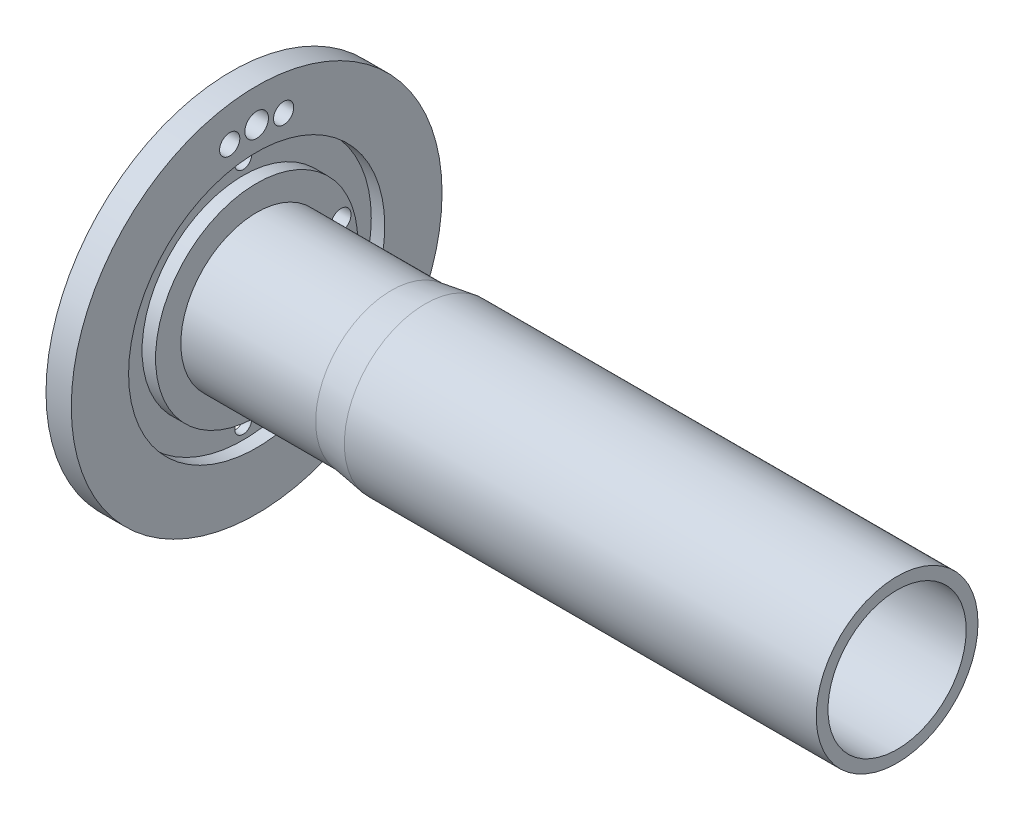
ISO-10303-21;
HEADER;
FILE_DESCRIPTION(('STEP AP214'),'2;1');
FILE_NAME('part.step','',(''),(''),'','','');
FILE_SCHEMA(('AUTOMOTIVE_DESIGN { 1 0 10303 214 1 1 1 1 }'));
ENDSEC;
DATA;
#1=APPLICATION_CONTEXT('core data for automotive mechanical design processes');
#2=APPLICATION_PROTOCOL_DEFINITION('international standard','automotive_design',2000,#1);
#3=PRODUCT_CONTEXT('',#1,'mechanical');
#4=PRODUCT('Part','Part','',(#3));
#5=PRODUCT_RELATED_PRODUCT_CATEGORY('part','',(#4));
#6=PRODUCT_DEFINITION_FORMATION('','',#4);
#7=PRODUCT_DEFINITION_CONTEXT('part definition',#1,'design');
#8=PRODUCT_DEFINITION('design','',#6,#7);
#9=PRODUCT_DEFINITION_SHAPE('','',#8);
#10=(LENGTH_UNIT() NAMED_UNIT(*) SI_UNIT(.MILLI.,.METRE.));
#11=(NAMED_UNIT(*) PLANE_ANGLE_UNIT() SI_UNIT($,.RADIAN.));
#12=(NAMED_UNIT(*) SI_UNIT($,.STERADIAN.) SOLID_ANGLE_UNIT());
#13=UNCERTAINTY_MEASURE_WITH_UNIT(LENGTH_MEASURE(1.E-05),#10,'distance_accuracy_value','');
#14=(GEOMETRIC_REPRESENTATION_CONTEXT(3) GLOBAL_UNCERTAINTY_ASSIGNED_CONTEXT((#13)) GLOBAL_UNIT_ASSIGNED_CONTEXT((#10,
#11,#12)) REPRESENTATION_CONTEXT('',''));
#15=CARTESIAN_POINT('',(0.,0.,0.));
#16=DIRECTION('',(0.,0.,1.));
#17=DIRECTION('',(1.,0.,0.));
#18=AXIS2_PLACEMENT_3D('',#15,#16,#17);
#19=CARTESIAN_POINT('',(3.,0.,0.));
#20=DIRECTION('',(-1.,0.,0.));
#21=DIRECTION('',(0.,0.,1.));
#22=AXIS2_PLACEMENT_3D('',#19,#20,#21);
#23=CYLINDRICAL_SURFACE('',#22,37.5);
#24=CARTESIAN_POINT('',(2.5,0.,0.));
#25=DIRECTION('',(-1.,0.,0.));
#26=DIRECTION('',(0.,0.,1.));
#27=AXIS2_PLACEMENT_3D('',#24,#25,#26);
#28=CIRCLE('',#27,37.5);
#29=CARTESIAN_POINT('',(2.5,37.3125,3.74530956664461));
#30=VERTEX_POINT('',#29);
#31=CARTESIAN_POINT('',(2.5,-37.3125,3.74530956664462));
#32=VERTEX_POINT('',#31);
#33=EDGE_CURVE('E60',#30,#32,#28,.F.);
#34=ORIENTED_EDGE('',*,*,#33,.F.);
#35=DIRECTION('',(-1.,0.,0.));
#36=VECTOR('',#35,1.);
#37=CARTESIAN_POINT('',(1.85,37.3125,3.74530956664462));
#38=LINE('',#37,#36);
#39=CARTESIAN_POINT('',(3.,37.3125,3.74530956664458));
#40=VERTEX_POINT('',#39);
#41=EDGE_CURVE('E155',#30,#40,#38,.F.);
#42=ORIENTED_EDGE('',*,*,#41,.T.);
#43=CARTESIAN_POINT('',(3.,0.,0.));
#44=DIRECTION('',(-1.,0.,0.));
#45=DIRECTION('',(0.,0.,1.));
#46=AXIS2_PLACEMENT_3D('',#43,#44,#45);
#47=CIRCLE('',#46,37.5);
#48=CARTESIAN_POINT('',(3.,-37.3125,3.74530956664458));
#49=VERTEX_POINT('',#48);
#50=EDGE_CURVE('E368',#49,#40,#47,.T.);
#51=ORIENTED_EDGE('',*,*,#50,.F.);
#52=DIRECTION('',(-1.,0.,0.));
#53=VECTOR('',#52,1.);
#54=CARTESIAN_POINT('',(1.85,-37.3125,3.74530956664462));
#55=LINE('',#54,#53);
#56=EDGE_CURVE('E134',#49,#32,#55,.T.);
#57=ORIENTED_EDGE('',*,*,#56,.T.);
#58=EDGE_LOOP('',(#34,#42,#51,#57));
#59=FACE_BOUND('',#58,.T.);
#60=ADVANCED_FACE('F43',(#59),#23,.F.);
#61=CARTESIAN_POINT('',(3.,0.,0.));
#62=DIRECTION('',(-1.,0.,0.));
#63=DIRECTION('',(0.,0.,1.));
#64=AXIS2_PLACEMENT_3D('',#61,#62,#63);
#65=CYLINDRICAL_SURFACE('',#64,30.5);
#66=DIRECTION('',(-1.,0.,0.));
#67=VECTOR('',#66,1.);
#68=CARTESIAN_POINT('',(1.85,30.3125,3.37673566481002));
#69=LINE('',#68,#67);
#70=CARTESIAN_POINT('',(2.5,30.3125,3.37673566481002));
#71=VERTEX_POINT('',#70);
#72=CARTESIAN_POINT('',(3.,30.3125,3.37673566481002));
#73=VERTEX_POINT('',#72);
#74=EDGE_CURVE('E127',#71,#73,#69,.F.);
#75=ORIENTED_EDGE('',*,*,#74,.F.);
#76=CARTESIAN_POINT('',(2.5,0.,0.));
#77=DIRECTION('',(-1.,0.,0.));
#78=DIRECTION('',(0.,0.,1.));
#79=AXIS2_PLACEMENT_3D('',#76,#77,#78);
#80=CIRCLE('',#79,30.5);
#81=CARTESIAN_POINT('',(2.5,-30.3125,3.37673566481002));
#82=VERTEX_POINT('',#81);
#83=EDGE_CURVE('E114',#71,#82,#80,.F.);
#84=ORIENTED_EDGE('',*,*,#83,.T.);
#85=DIRECTION('',(-1.,0.,0.));
#86=VECTOR('',#85,1.);
#87=CARTESIAN_POINT('',(1.85,-30.3125,3.37673566481002));
#88=LINE('',#87,#86);
#89=CARTESIAN_POINT('',(3.,-30.3125,3.37673566481));
#90=VERTEX_POINT('',#89);
#91=EDGE_CURVE('E12',#90,#82,#88,.T.);
#92=ORIENTED_EDGE('',*,*,#91,.F.);
#93=CARTESIAN_POINT('',(3.,0.,0.));
#94=DIRECTION('',(-1.,0.,0.));
#95=DIRECTION('',(0.,0.,1.));
#96=AXIS2_PLACEMENT_3D('',#93,#94,#95);
#97=CIRCLE('',#96,30.5);
#98=EDGE_CURVE('E371',#90,#73,#97,.T.);
#99=ORIENTED_EDGE('',*,*,#98,.T.);
#100=EDGE_LOOP('',(#75,#84,#92,#99));
#101=FACE_BOUND('',#100,.T.);
#102=ADVANCED_FACE('F124',(#101),#65,.T.);
#103=CARTESIAN_POINT('',(10.,0.,0.));
#104=DIRECTION('',(-1.,0.,0.));
#105=DIRECTION('',(0.,0.,1.));
#106=AXIS2_PLACEMENT_3D('',#103,#104,#105);
#107=CYLINDRICAL_SURFACE('',#106,55.);
#108=CARTESIAN_POINT('',(10.,0.,0.));
#109=DIRECTION('',(1.,0.,0.));
#110=DIRECTION('',(0.,0.,-1.));
#111=AXIS2_PLACEMENT_3D('',#108,#109,#110);
#112=CIRCLE('',#111,55.);
#113=CARTESIAN_POINT('',(10.,0.,-55.));
#114=VERTEX_POINT('',#113);
#115=EDGE_CURVE('E345',#114,#114,#112,.T.);
#116=ORIENTED_EDGE('',*,*,#115,.F.);
#117=EDGE_LOOP('',(#116));
#118=FACE_BOUND('',#117,.T.);
#119=CARTESIAN_POINT('',(2.5,0.,0.));
#120=DIRECTION('',(-1.,0.,0.));
#121=DIRECTION('',(0.,0.,1.));
#122=AXIS2_PLACEMENT_3D('',#119,#120,#121);
#123=CIRCLE('',#122,55.);
#124=CARTESIAN_POINT('',(2.5,0.,55.));
#125=VERTEX_POINT('',#124);
#126=EDGE_CURVE('E401',#125,#125,#123,.T.);
#127=ORIENTED_EDGE('',*,*,#126,.F.);
#128=EDGE_LOOP('',(#127));
#129=FACE_BOUND('',#128,.T.);
#130=ADVANCED_FACE('F45',(#118,#129),#107,.T.);
#131=CARTESIAN_POINT('',(50.,0.,0.));
#132=DIRECTION('',(-1.,0.,0.));
#133=DIRECTION('',(0.,0.,1.));
#134=AXIS2_PLACEMENT_3D('',#131,#132,#133);
#135=CYLINDRICAL_SURFACE('',#134,19.);
#136=CARTESIAN_POINT('',(50.,0.,0.));
#137=DIRECTION('',(-1.,0.,0.));
#138=DIRECTION('',(0.,0.,1.));
#139=AXIS2_PLACEMENT_3D('',#136,#137,#138);
#140=CIRCLE('',#139,19.);
#141=CARTESIAN_POINT('',(50.,0.,19.));
#142=VERTEX_POINT('',#141);
#143=EDGE_CURVE('E321',#142,#142,#140,.T.);
#144=ORIENTED_EDGE('',*,*,#143,.F.);
#145=EDGE_LOOP('',(#144));
#146=FACE_BOUND('',#145,.T.);
#147=CARTESIAN_POINT('',(2.5,0.,0.));
#148=DIRECTION('',(-1.,0.,0.));
#149=DIRECTION('',(0.,0.,1.));
#150=AXIS2_PLACEMENT_3D('',#147,#148,#149);
#151=CIRCLE('',#150,19.);
#152=CARTESIAN_POINT('',(2.5,0.,19.));
#153=VERTEX_POINT('',#152);
#154=EDGE_CURVE('E403',#153,#153,#151,.F.);
#155=ORIENTED_EDGE('',*,*,#154,.F.);
#156=EDGE_LOOP('',(#155));
#157=FACE_BOUND('',#156,.T.);
#158=ADVANCED_FACE('F312',(#146,#157),#135,.F.);
#159=CARTESIAN_POINT('',(2.5,0.,0.));
#160=DIRECTION('',(-1.,0.,0.));
#161=DIRECTION('',(0.,0.,1.));
#162=AXIS2_PLACEMENT_3D('',#159,#160,#161);
#163=CIRCLE('',#162,37.5);
#164=CARTESIAN_POINT('',(2.5,-37.3125,-3.74530956664463));
#165=VERTEX_POINT('',#164);
#166=CARTESIAN_POINT('',(2.5,37.3125,-3.74530956664461));
#167=VERTEX_POINT('',#166);
#168=EDGE_CURVE('E458',#165,#167,#163,.F.);
#169=ORIENTED_EDGE('',*,*,#168,.F.);
#170=DIRECTION('',(-1.,0.,0.));
#171=VECTOR('',#170,1.);
#172=CARTESIAN_POINT('',(1.85,-37.3125,-3.74530956664462));
#173=LINE('',#172,#171);
#174=CARTESIAN_POINT('',(3.,-37.3125,-3.74530956664458));
#175=VERTEX_POINT('',#174);
#176=EDGE_CURVE('E138',#165,#175,#173,.F.);
#177=ORIENTED_EDGE('',*,*,#176,.T.);
#178=CARTESIAN_POINT('',(3.,37.3125,-3.74530956664458));
#179=VERTEX_POINT('',#178);
#180=EDGE_CURVE('E346',#179,#175,#47,.T.);
#181=ORIENTED_EDGE('',*,*,#180,.F.);
#182=DIRECTION('',(-1.,0.,0.));
#183=VECTOR('',#182,1.);
#184=CARTESIAN_POINT('',(1.85,37.3125,-3.74530956664462));
#185=LINE('',#184,#183);
#186=EDGE_CURVE('E146',#179,#167,#185,.T.);
#187=ORIENTED_EDGE('',*,*,#186,.T.);
#188=EDGE_LOOP('',(#169,#177,#181,#187));
#189=FACE_BOUND('',#188,.T.);
#190=ADVANCED_FACE('F311',(#189),#23,.F.);
#191=DIRECTION('',(-1.,0.,0.));
#192=VECTOR('',#191,1.);
#193=CARTESIAN_POINT('',(1.85,-30.3125,-3.37673566481002));
#194=LINE('',#193,#192);
#195=CARTESIAN_POINT('',(2.5,-30.3125,-3.37673566481002));
#196=VERTEX_POINT('',#195);
#197=CARTESIAN_POINT('',(3.,-30.3125,-3.37673566481002));
#198=VERTEX_POINT('',#197);
#199=EDGE_CURVE('E52',#196,#198,#194,.F.);
#200=ORIENTED_EDGE('',*,*,#199,.F.);
#201=CARTESIAN_POINT('',(2.5,0.,0.));
#202=DIRECTION('',(-1.,0.,0.));
#203=DIRECTION('',(0.,0.,1.));
#204=AXIS2_PLACEMENT_3D('',#201,#202,#203);
#205=CIRCLE('',#204,30.5);
#206=CARTESIAN_POINT('',(2.5,30.3125,-3.37673566481002));
#207=VERTEX_POINT('',#206);
#208=EDGE_CURVE('E68',#196,#207,#205,.F.);
#209=ORIENTED_EDGE('',*,*,#208,.T.);
#210=DIRECTION('',(-1.,0.,0.));
#211=VECTOR('',#210,1.);
#212=CARTESIAN_POINT('',(1.85,30.3125,-3.37673566481002));
#213=LINE('',#212,#211);
#214=CARTESIAN_POINT('',(3.,30.3125,-3.37673566481002));
#215=VERTEX_POINT('',#214);
#216=EDGE_CURVE('E349',#215,#207,#213,.T.);
#217=ORIENTED_EDGE('',*,*,#216,.F.);
#218=EDGE_CURVE('E370',#215,#198,#97,.T.);
#219=ORIENTED_EDGE('',*,*,#218,.T.);
#220=EDGE_LOOP('',(#200,#209,#217,#219));
#221=FACE_BOUND('',#220,.T.);
#222=ADVANCED_FACE('F276',(#221),#65,.T.);
#223=CARTESIAN_POINT('',(3.7,34.,0.));
#224=DIRECTION('',(-1.,0.,0.));
#225=DIRECTION('',(0.,0.,1.));
#226=AXIS2_PLACEMENT_3D('',#223,#224,#225);
#227=CYLINDRICAL_SURFACE('',#226,5.);
#228=CARTESIAN_POINT('',(3.7,34.,0.));
#229=DIRECTION('',(-1.,0.,0.));
#230=DIRECTION('',(0.,0.,1.));
#231=AXIS2_PLACEMENT_3D('',#228,#229,#230);
#232=CIRCLE('',#231,5.);
#233=CARTESIAN_POINT('',(3.7,34.,5.));
#234=VERTEX_POINT('',#233);
#235=EDGE_CURVE('E162',#234,#234,#232,.T.);
#236=ORIENTED_EDGE('',*,*,#235,.F.);
#237=EDGE_LOOP('',(#236));
#238=FACE_BOUND('',#237,.T.);
#239=CARTESIAN_POINT('',(2.5,34.,0.));
#240=DIRECTION('',(-1.,0.,0.));
#241=DIRECTION('',(0.,0.,1.));
#242=AXIS2_PLACEMENT_3D('',#239,#240,#241);
#243=CIRCLE('',#242,5.);
#244=EDGE_CURVE('E128',#71,#207,#243,.F.);
#245=ORIENTED_EDGE('',*,*,#244,.F.);
#246=ORIENTED_EDGE('',*,*,#74,.T.);
#247=CARTESIAN_POINT('',(3.,34.,0.));
#248=DIRECTION('',(-1.,0.,0.));
#249=DIRECTION('',(0.,0.,1.));
#250=AXIS2_PLACEMENT_3D('',#247,#248,#249);
#251=CIRCLE('',#250,5.);
#252=EDGE_CURVE('E157',#73,#40,#251,.T.);
#253=ORIENTED_EDGE('',*,*,#252,.T.);
#254=ORIENTED_EDGE('',*,*,#41,.F.);
#255=EDGE_CURVE('E406',#167,#30,#243,.F.);
#256=ORIENTED_EDGE('',*,*,#255,.F.);
#257=ORIENTED_EDGE('',*,*,#186,.F.);
#258=EDGE_CURVE('E151',#179,#215,#251,.T.);
#259=ORIENTED_EDGE('',*,*,#258,.T.);
#260=ORIENTED_EDGE('',*,*,#216,.T.);
#261=EDGE_LOOP('',(#245,#246,#253,#254,#256,#257,#259,#260));
#262=FACE_BOUND('',#261,.T.);
#263=ADVANCED_FACE('F272',(#238,#262),#227,.F.);
#264=CARTESIAN_POINT('',(3.7,-34.,0.));
#265=DIRECTION('',(-1.,0.,0.));
#266=DIRECTION('',(0.,0.,1.));
#267=AXIS2_PLACEMENT_3D('',#264,#265,#266);
#268=CYLINDRICAL_SURFACE('',#267,5.);
#269=CARTESIAN_POINT('',(3.7,-34.,0.));
#270=DIRECTION('',(-1.,0.,0.));
#271=DIRECTION('',(0.,0.,1.));
#272=AXIS2_PLACEMENT_3D('',#269,#270,#271);
#273=CIRCLE('',#272,5.);
#274=CARTESIAN_POINT('',(3.7,-34.,5.));
#275=VERTEX_POINT('',#274);
#276=EDGE_CURVE('E165',#275,#275,#273,.T.);
#277=ORIENTED_EDGE('',*,*,#276,.F.);
#278=EDGE_LOOP('',(#277));
#279=FACE_BOUND('',#278,.T.);
#280=CARTESIAN_POINT('',(2.5,-34.,0.));
#281=DIRECTION('',(-1.,0.,0.));
#282=DIRECTION('',(0.,0.,1.));
#283=AXIS2_PLACEMENT_3D('',#280,#281,#282);
#284=CIRCLE('',#283,5.);
#285=EDGE_CURVE('E120',#32,#165,#284,.F.);
#286=ORIENTED_EDGE('',*,*,#285,.F.);
#287=ORIENTED_EDGE('',*,*,#56,.F.);
#288=CARTESIAN_POINT('',(3.,-34.,0.));
#289=DIRECTION('',(-1.,0.,0.));
#290=DIRECTION('',(0.,0.,1.));
#291=AXIS2_PLACEMENT_3D('',#288,#289,#290);
#292=CIRCLE('',#291,5.);
#293=EDGE_CURVE('E132',#49,#90,#292,.T.);
#294=ORIENTED_EDGE('',*,*,#293,.T.);
#295=ORIENTED_EDGE('',*,*,#91,.T.);
#296=EDGE_CURVE('E110',#196,#82,#284,.F.);
#297=ORIENTED_EDGE('',*,*,#296,.F.);
#298=ORIENTED_EDGE('',*,*,#199,.T.);
#299=EDGE_CURVE('E140',#198,#175,#292,.T.);
#300=ORIENTED_EDGE('',*,*,#299,.T.);
#301=ORIENTED_EDGE('',*,*,#176,.F.);
#302=EDGE_LOOP('',(#286,#287,#294,#295,#297,#298,#300,#301));
#303=FACE_BOUND('',#302,.T.);
#304=ADVANCED_FACE('F130',(#279,#303),#268,.F.);
#305=CARTESIAN_POINT('',(10.,0.,-26.));
#306=DIRECTION('',(-1.,0.,0.));
#307=DIRECTION('',(0.,0.,1.));
#308=AXIS2_PLACEMENT_3D('',#305,#306,#307);
#309=CYLINDRICAL_SURFACE('',#308,3.5);
#310=CARTESIAN_POINT('',(10.,0.,-26.));
#311=DIRECTION('',(-1.,0.,0.));
#312=DIRECTION('',(0.,0.,1.));
#313=AXIS2_PLACEMENT_3D('',#310,#311,#312);
#314=CIRCLE('',#313,3.5);
#315=CARTESIAN_POINT('',(10.,0.,-22.5));
#316=VERTEX_POINT('',#315);
#317=EDGE_CURVE('E166',#316,#316,#314,.T.);
#318=ORIENTED_EDGE('',*,*,#317,.F.);
#319=EDGE_LOOP('',(#318));
#320=FACE_BOUND('',#319,.T.);
#321=CARTESIAN_POINT('',(2.5,0.,-26.));
#322=DIRECTION('',(-1.,0.,0.));
#323=DIRECTION('',(0.,0.,1.));
#324=AXIS2_PLACEMENT_3D('',#321,#322,#323);
#325=CIRCLE('',#324,3.5);
#326=CARTESIAN_POINT('',(2.5,0.,-22.5));
#327=VERTEX_POINT('',#326);
#328=EDGE_CURVE('E118',#327,#327,#325,.F.);
#329=ORIENTED_EDGE('',*,*,#328,.F.);
#330=EDGE_LOOP('',(#329));
#331=FACE_BOUND('',#330,.T.);
#332=ADVANCED_FACE('F258',(#320,#331),#309,.F.);
#333=CARTESIAN_POINT('',(10.,-8.,-25.));
#334=DIRECTION('',(-1.,0.,0.));
#335=DIRECTION('',(0.,0.,1.));
#336=AXIS2_PLACEMENT_3D('',#333,#334,#335);
#337=CYLINDRICAL_SURFACE('',#336,3.);
#338=CARTESIAN_POINT('',(10.,-8.,-25.));
#339=DIRECTION('',(-1.,0.,0.));
#340=DIRECTION('',(0.,0.,1.));
#341=AXIS2_PLACEMENT_3D('',#338,#339,#340);
#342=CIRCLE('',#341,3.);
#343=CARTESIAN_POINT('',(10.,-8.,-22.));
#344=VERTEX_POINT('',#343);
#345=EDGE_CURVE('E172',#344,#344,#342,.T.);
#346=ORIENTED_EDGE('',*,*,#345,.F.);
#347=EDGE_LOOP('',(#346));
#348=FACE_BOUND('',#347,.T.);
#349=CARTESIAN_POINT('',(2.5,-8.,-25.));
#350=DIRECTION('',(-1.,0.,0.));
#351=DIRECTION('',(0.,0.,1.));
#352=AXIS2_PLACEMENT_3D('',#349,#350,#351);
#353=CIRCLE('',#352,3.);
#354=CARTESIAN_POINT('',(2.5,-8.,-22.));
#355=VERTEX_POINT('',#354);
#356=EDGE_CURVE('E442',#355,#355,#353,.F.);
#357=ORIENTED_EDGE('',*,*,#356,.F.);
#358=EDGE_LOOP('',(#357));
#359=FACE_BOUND('',#358,.T.);
#360=ADVANCED_FACE('F255',(#348,#359),#337,.F.);
#361=CARTESIAN_POINT('',(10.,8.,-25.));
#362=DIRECTION('',(-1.,0.,0.));
#363=DIRECTION('',(0.,0.,1.));
#364=AXIS2_PLACEMENT_3D('',#361,#362,#363);
#365=CYLINDRICAL_SURFACE('',#364,3.);
#366=CARTESIAN_POINT('',(10.,8.,-25.));
#367=DIRECTION('',(-1.,0.,0.));
#368=DIRECTION('',(0.,0.,1.));
#369=AXIS2_PLACEMENT_3D('',#366,#367,#368);
#370=CIRCLE('',#369,3.);
#371=CARTESIAN_POINT('',(10.,8.,-22.));
#372=VERTEX_POINT('',#371);
#373=EDGE_CURVE('E173',#372,#372,#370,.T.);
#374=ORIENTED_EDGE('',*,*,#373,.F.);
#375=EDGE_LOOP('',(#374));
#376=FACE_BOUND('',#375,.T.);
#377=CARTESIAN_POINT('',(2.5,8.,-25.));
#378=DIRECTION('',(-1.,0.,0.));
#379=DIRECTION('',(0.,0.,1.));
#380=AXIS2_PLACEMENT_3D('',#377,#378,#379);
#381=CIRCLE('',#380,3.);
#382=CARTESIAN_POINT('',(2.5,8.,-22.));
#383=VERTEX_POINT('',#382);
#384=EDGE_CURVE('E445',#383,#383,#381,.F.);
#385=ORIENTED_EDGE('',*,*,#384,.F.);
#386=EDGE_LOOP('',(#385));
#387=FACE_BOUND('',#386,.T.);
#388=ADVANCED_FACE('F253',(#376,#387),#365,.F.);
#389=CARTESIAN_POINT('',(10.,45.,0.));
#390=DIRECTION('',(-1.,0.,0.));
#391=DIRECTION('',(0.,0.,1.));
#392=AXIS2_PLACEMENT_3D('',#389,#390,#391);
#393=CYLINDRICAL_SURFACE('',#392,3.5);
#394=CARTESIAN_POINT('',(10.,45.,0.));
#395=DIRECTION('',(-1.,0.,0.));
#396=DIRECTION('',(0.,0.,1.));
#397=AXIS2_PLACEMENT_3D('',#394,#395,#396);
#398=CIRCLE('',#397,3.5);
#399=CARTESIAN_POINT('',(10.,45.,3.5));
#400=VERTEX_POINT('',#399);
#401=EDGE_CURVE('E176',#400,#400,#398,.T.);
#402=ORIENTED_EDGE('',*,*,#401,.F.);
#403=EDGE_LOOP('',(#402));
#404=FACE_BOUND('',#403,.T.);
#405=CARTESIAN_POINT('',(2.5,45.,0.));
#406=DIRECTION('',(-1.,0.,0.));
#407=DIRECTION('',(0.,0.,1.));
#408=AXIS2_PLACEMENT_3D('',#405,#406,#407);
#409=CIRCLE('',#408,3.5);
#410=CARTESIAN_POINT('',(2.5,45.,3.5));
#411=VERTEX_POINT('',#410);
#412=EDGE_CURVE('E447',#411,#411,#409,.F.);
#413=ORIENTED_EDGE('',*,*,#412,.F.);
#414=EDGE_LOOP('',(#413));
#415=FACE_BOUND('',#414,.T.);
#416=ADVANCED_FACE('F245',(#404,#415),#393,.F.);
#417=CARTESIAN_POINT('',(10.,44.,-8.));
#418=DIRECTION('',(-1.,0.,0.));
#419=DIRECTION('',(0.,0.,1.));
#420=AXIS2_PLACEMENT_3D('',#417,#418,#419);
#421=CYLINDRICAL_SURFACE('',#420,3.);
#422=CARTESIAN_POINT('',(10.,44.,-8.));
#423=DIRECTION('',(-1.,0.,0.));
#424=DIRECTION('',(0.,0.,1.));
#425=AXIS2_PLACEMENT_3D('',#422,#423,#424);
#426=CIRCLE('',#425,3.);
#427=CARTESIAN_POINT('',(10.,44.,-5.));
#428=VERTEX_POINT('',#427);
#429=EDGE_CURVE('E181',#428,#428,#426,.T.);
#430=ORIENTED_EDGE('',*,*,#429,.F.);
#431=EDGE_LOOP('',(#430));
#432=FACE_BOUND('',#431,.T.);
#433=CARTESIAN_POINT('',(2.5,44.,-8.));
#434=DIRECTION('',(-1.,0.,0.));
#435=DIRECTION('',(0.,0.,1.));
#436=AXIS2_PLACEMENT_3D('',#433,#434,#435);
#437=CIRCLE('',#436,3.);
#438=CARTESIAN_POINT('',(2.5,44.,-5.));
#439=VERTEX_POINT('',#438);
#440=EDGE_CURVE('E451',#439,#439,#437,.F.);
#441=ORIENTED_EDGE('',*,*,#440,.F.);
#442=EDGE_LOOP('',(#441));
#443=FACE_BOUND('',#442,.T.);
#444=ADVANCED_FACE('F241',(#432,#443),#421,.F.);
#445=CARTESIAN_POINT('',(10.,44.,8.));
#446=DIRECTION('',(-1.,0.,0.));
#447=DIRECTION('',(0.,0.,1.));
#448=AXIS2_PLACEMENT_3D('',#445,#446,#447);
#449=CYLINDRICAL_SURFACE('',#448,3.);
#450=CARTESIAN_POINT('',(10.,44.,8.));
#451=DIRECTION('',(-1.,0.,0.));
#452=DIRECTION('',(0.,0.,1.));
#453=AXIS2_PLACEMENT_3D('',#450,#451,#452);
#454=CIRCLE('',#453,3.);
#455=CARTESIAN_POINT('',(10.,44.,11.));
#456=VERTEX_POINT('',#455);
#457=EDGE_CURVE('E182',#456,#456,#454,.T.);
#458=ORIENTED_EDGE('',*,*,#457,.F.);
#459=EDGE_LOOP('',(#458));
#460=FACE_BOUND('',#459,.T.);
#461=CARTESIAN_POINT('',(2.5,44.,8.));
#462=DIRECTION('',(-1.,0.,0.));
#463=DIRECTION('',(0.,0.,1.));
#464=AXIS2_PLACEMENT_3D('',#461,#462,#463);
#465=CIRCLE('',#464,3.);
#466=CARTESIAN_POINT('',(2.5,44.,11.));
#467=VERTEX_POINT('',#466);
#468=EDGE_CURVE('E47',#467,#467,#465,.F.);
#469=ORIENTED_EDGE('',*,*,#468,.F.);
#470=EDGE_LOOP('',(#469));
#471=FACE_BOUND('',#470,.T.);
#472=ADVANCED_FACE('F244',(#460,#471),#449,.F.);
#473=CARTESIAN_POINT('',(3.,0.,0.));
#474=DIRECTION('',(-1.,0.,0.));
#475=DIRECTION('',(0.,0.,1.));
#476=AXIS2_PLACEMENT_3D('',#473,#474,#475);
#477=PLANE('',#476);
#478=ORIENTED_EDGE('',*,*,#299,.F.);
#479=ORIENTED_EDGE('',*,*,#218,.F.);
#480=ORIENTED_EDGE('',*,*,#258,.F.);
#481=ORIENTED_EDGE('',*,*,#180,.T.);
#482=EDGE_LOOP('',(#478,#479,#480,#481));
#483=FACE_BOUND('',#482,.T.);
#484=ADVANCED_FACE('F249',(#483),#477,.T.);
#485=CARTESIAN_POINT('',(50.,-34.,0.));
#486=DIRECTION('',(-1.,0.,0.));
#487=DIRECTION('',(0.,0.,1.));
#488=AXIS2_PLACEMENT_3D('',#485,#486,#487);
#489=CYLINDRICAL_SURFACE('',#488,2.5);
#490=CARTESIAN_POINT('',(6.,-34.,0.));
#491=DIRECTION('',(1.,0.,0.));
#492=DIRECTION('',(0.,0.,-1.));
#493=AXIS2_PLACEMENT_3D('',#490,#491,#492);
#494=CIRCLE('',#493,2.5);
#495=CARTESIAN_POINT('',(6.,-34.,-2.5));
#496=VERTEX_POINT('',#495);
#497=EDGE_CURVE('E141',#496,#496,#494,.T.);
#498=ORIENTED_EDGE('',*,*,#497,.T.);
#499=EDGE_LOOP('',(#498));
#500=FACE_BOUND('',#499,.T.);
#501=CARTESIAN_POINT('',(3.7,-34.,0.));
#502=DIRECTION('',(-1.,0.,0.));
#503=DIRECTION('',(0.,0.,1.));
#504=AXIS2_PLACEMENT_3D('',#501,#502,#503);
#505=CIRCLE('',#504,2.5);
#506=CARTESIAN_POINT('',(3.7,-34.,2.5));
#507=VERTEX_POINT('',#506);
#508=EDGE_CURVE('E161',#507,#507,#505,.F.);
#509=ORIENTED_EDGE('',*,*,#508,.F.);
#510=EDGE_LOOP('',(#509));
#511=FACE_BOUND('',#510,.T.);
#512=ADVANCED_FACE('F286',(#500,#511),#489,.F.);
#513=CARTESIAN_POINT('',(50.,34.,0.));
#514=DIRECTION('',(-1.,0.,0.));
#515=DIRECTION('',(0.,0.,1.));
#516=AXIS2_PLACEMENT_3D('',#513,#514,#515);
#517=CYLINDRICAL_SURFACE('',#516,2.5);
#518=CARTESIAN_POINT('',(6.,34.,0.));
#519=DIRECTION('',(1.,0.,0.));
#520=DIRECTION('',(0.,0.,-1.));
#521=AXIS2_PLACEMENT_3D('',#518,#519,#520);
#522=CIRCLE('',#521,2.5);
#523=CARTESIAN_POINT('',(6.,34.,-2.5));
#524=VERTEX_POINT('',#523);
#525=EDGE_CURVE('E358',#524,#524,#522,.T.);
#526=ORIENTED_EDGE('',*,*,#525,.T.);
#527=EDGE_LOOP('',(#526));
#528=FACE_BOUND('',#527,.T.);
#529=CARTESIAN_POINT('',(3.7,34.,0.));
#530=DIRECTION('',(-1.,0.,0.));
#531=DIRECTION('',(0.,0.,1.));
#532=AXIS2_PLACEMENT_3D('',#529,#530,#531);
#533=CIRCLE('',#532,2.5);
#534=CARTESIAN_POINT('',(3.7,34.,2.5));
#535=VERTEX_POINT('',#534);
#536=EDGE_CURVE('E169',#535,#535,#533,.F.);
#537=ORIENTED_EDGE('',*,*,#536,.F.);
#538=EDGE_LOOP('',(#537));
#539=FACE_BOUND('',#538,.T.);
#540=ADVANCED_FACE('F282',(#528,#539),#517,.F.);
#541=CARTESIAN_POINT('',(10.,0.,0.));
#542=DIRECTION('',(1.,0.,0.));
#543=DIRECTION('',(0.,0.,-1.));
#544=AXIS2_PLACEMENT_3D('',#541,#542,#543);
#545=PLANE('',#544);
#546=ORIENTED_EDGE('',*,*,#373,.T.);
#547=EDGE_LOOP('',(#546));
#548=FACE_BOUND('',#547,.T.);
#549=ORIENTED_EDGE('',*,*,#345,.T.);
#550=EDGE_LOOP('',(#549));
#551=FACE_BOUND('',#550,.T.);
#552=CARTESIAN_POINT('',(10.,0.,0.));
#553=DIRECTION('',(1.,0.,0.));
#554=DIRECTION('',(0.,0.,-1.));
#555=AXIS2_PLACEMENT_3D('',#552,#553,#554);
#556=CIRCLE('',#555,22.5);
#557=EDGE_CURVE('E353',#316,#316,#556,.T.);
#558=ORIENTED_EDGE('',*,*,#557,.F.);
#559=ORIENTED_EDGE('',*,*,#317,.T.);
#560=EDGE_LOOP('',(#558,#559));
#561=FACE_BOUND('',#560,.T.);
#562=CARTESIAN_POINT('',(10.,0.,0.));
#563=DIRECTION('',(1.,0.,0.));
#564=DIRECTION('',(0.,0.,-1.));
#565=AXIS2_PLACEMENT_3D('',#562,#563,#564);
#566=CIRCLE('',#565,30.);
#567=CARTESIAN_POINT('',(10.,0.,-30.));
#568=VERTEX_POINT('',#567);
#569=EDGE_CURVE('E361',#568,#568,#566,.T.);
#570=ORIENTED_EDGE('',*,*,#569,.T.);
#571=EDGE_LOOP('',(#570));
#572=FACE_BOUND('',#571,.T.);
#573=ADVANCED_FACE('F285',(#548,#551,#561,#572),#545,.T.);
#574=ORIENTED_EDGE('',*,*,#457,.T.);
#575=EDGE_LOOP('',(#574));
#576=FACE_BOUND('',#575,.T.);
#577=ORIENTED_EDGE('',*,*,#429,.T.);
#578=EDGE_LOOP('',(#577));
#579=FACE_BOUND('',#578,.T.);
#580=ORIENTED_EDGE('',*,*,#401,.T.);
#581=EDGE_LOOP('',(#580));
#582=FACE_BOUND('',#581,.T.);
#583=CARTESIAN_POINT('',(10.,0.,0.));
#584=DIRECTION('',(1.,0.,0.));
#585=DIRECTION('',(0.,0.,-1.));
#586=AXIS2_PLACEMENT_3D('',#583,#584,#585);
#587=CIRCLE('',#586,38.);
#588=CARTESIAN_POINT('',(10.,0.,-38.));
#589=VERTEX_POINT('',#588);
#590=EDGE_CURVE('E374',#589,#589,#587,.T.);
#591=ORIENTED_EDGE('',*,*,#590,.F.);
#592=EDGE_LOOP('',(#591));
#593=FACE_BOUND('',#592,.T.);
#594=ORIENTED_EDGE('',*,*,#115,.T.);
#595=EDGE_LOOP('',(#594));
#596=FACE_BOUND('',#595,.T.);
#597=ADVANCED_FACE('F391',(#576,#579,#582,#593,#596),#545,.T.);
#598=CARTESIAN_POINT('',(50.,0.,0.));
#599=DIRECTION('',(-1.,0.,0.));
#600=DIRECTION('',(0.,0.,1.));
#601=AXIS2_PLACEMENT_3D('',#598,#599,#600);
#602=CYLINDRICAL_SURFACE('',#601,22.5);
#603=CARTESIAN_POINT('',(50.,0.,0.));
#604=DIRECTION('',(1.,0.,0.));
#605=DIRECTION('',(0.,0.,-1.));
#606=AXIS2_PLACEMENT_3D('',#603,#604,#605);
#607=CIRCLE('',#606,22.5);
#608=CARTESIAN_POINT('',(50.,0.,-22.5));
#609=VERTEX_POINT('',#608);
#610=EDGE_CURVE('E343',#609,#609,#607,.T.);
#611=ORIENTED_EDGE('',*,*,#610,.F.);
#612=EDGE_LOOP('',(#611));
#613=FACE_BOUND('',#612,.T.);
#614=ORIENTED_EDGE('',*,*,#557,.T.);
#615=EDGE_LOOP('',(#614));
#616=FACE_BOUND('',#615,.T.);
#617=ADVANCED_FACE('F307',(#613,#616),#602,.T.);
#618=ORIENTED_EDGE('',*,*,#293,.F.);
#619=ORIENTED_EDGE('',*,*,#50,.T.);
#620=ORIENTED_EDGE('',*,*,#252,.F.);
#621=ORIENTED_EDGE('',*,*,#98,.F.);
#622=EDGE_LOOP('',(#618,#619,#620,#621));
#623=FACE_BOUND('',#622,.T.);
#624=ADVANCED_FACE('F301',(#623),#477,.T.);
#625=CARTESIAN_POINT('',(6.,0.,0.));
#626=DIRECTION('',(1.,0.,0.));
#627=DIRECTION('',(0.,0.,-1.));
#628=AXIS2_PLACEMENT_3D('',#625,#626,#627);
#629=CYLINDRICAL_SURFACE('',#628,38.);
#630=CARTESIAN_POINT('',(6.,0.,0.));
#631=DIRECTION('',(1.,0.,0.));
#632=DIRECTION('',(0.,0.,-1.));
#633=AXIS2_PLACEMENT_3D('',#630,#631,#632);
#634=CIRCLE('',#633,38.);
#635=CARTESIAN_POINT('',(6.,0.,-38.));
#636=VERTEX_POINT('',#635);
#637=EDGE_CURVE('E373',#636,#636,#634,.T.);
#638=ORIENTED_EDGE('',*,*,#637,.F.);
#639=EDGE_LOOP('',(#638));
#640=FACE_BOUND('',#639,.T.);
#641=ORIENTED_EDGE('',*,*,#590,.T.);
#642=EDGE_LOOP('',(#641));
#643=FACE_BOUND('',#642,.T.);
#644=ADVANCED_FACE('F297',(#640,#643),#629,.F.);
#645=CARTESIAN_POINT('',(6.,0.,0.));
#646=DIRECTION('',(1.,0.,0.));
#647=DIRECTION('',(0.,0.,-1.));
#648=AXIS2_PLACEMENT_3D('',#645,#646,#647);
#649=PLANE('',#648);
#650=ORIENTED_EDGE('',*,*,#525,.F.);
#651=EDGE_LOOP('',(#650));
#652=FACE_BOUND('',#651,.T.);
#653=ORIENTED_EDGE('',*,*,#497,.F.);
#654=EDGE_LOOP('',(#653));
#655=FACE_BOUND('',#654,.T.);
#656=CARTESIAN_POINT('',(6.,0.,0.));
#657=DIRECTION('',(1.,0.,0.));
#658=DIRECTION('',(0.,0.,-1.));
#659=AXIS2_PLACEMENT_3D('',#656,#657,#658);
#660=CIRCLE('',#659,30.);
#661=CARTESIAN_POINT('',(6.,0.,-30.));
#662=VERTEX_POINT('',#661);
#663=EDGE_CURVE('E377',#662,#662,#660,.T.);
#664=ORIENTED_EDGE('',*,*,#663,.F.);
#665=EDGE_LOOP('',(#664));
#666=FACE_BOUND('',#665,.T.);
#667=ORIENTED_EDGE('',*,*,#637,.T.);
#668=EDGE_LOOP('',(#667));
#669=FACE_BOUND('',#668,.T.);
#670=ADVANCED_FACE('F293',(#652,#655,#666,#669),#649,.T.);
#671=CARTESIAN_POINT('',(6.,0.,0.));
#672=DIRECTION('',(1.,0.,0.));
#673=DIRECTION('',(0.,0.,-1.));
#674=AXIS2_PLACEMENT_3D('',#671,#672,#673);
#675=CYLINDRICAL_SURFACE('',#674,30.);
#676=ORIENTED_EDGE('',*,*,#663,.T.);
#677=EDGE_LOOP('',(#676));
#678=FACE_BOUND('',#677,.T.);
#679=ORIENTED_EDGE('',*,*,#569,.F.);
#680=EDGE_LOOP('',(#679));
#681=FACE_BOUND('',#680,.T.);
#682=ADVANCED_FACE('F280',(#678,#681),#675,.T.);
#683=CARTESIAN_POINT('',(3.7,34.,0.));
#684=DIRECTION('',(-1.,0.,0.));
#685=DIRECTION('',(0.,0.,1.));
#686=AXIS2_PLACEMENT_3D('',#683,#684,#685);
#687=PLANE('',#686);
#688=ORIENTED_EDGE('',*,*,#235,.T.);
#689=EDGE_LOOP('',(#688));
#690=FACE_BOUND('',#689,.T.);
#691=ORIENTED_EDGE('',*,*,#536,.T.);
#692=EDGE_LOOP('',(#691));
#693=FACE_BOUND('',#692,.T.);
#694=ADVANCED_FACE('F268',(#690,#693),#687,.T.);
#695=CARTESIAN_POINT('',(3.7,-34.,0.));
#696=DIRECTION('',(-1.,0.,0.));
#697=DIRECTION('',(0.,0.,1.));
#698=AXIS2_PLACEMENT_3D('',#695,#696,#697);
#699=PLANE('',#698);
#700=ORIENTED_EDGE('',*,*,#276,.T.);
#701=EDGE_LOOP('',(#700));
#702=FACE_BOUND('',#701,.T.);
#703=ORIENTED_EDGE('',*,*,#508,.T.);
#704=EDGE_LOOP('',(#703));
#705=FACE_BOUND('',#704,.T.);
#706=ADVANCED_FACE('F239',(#702,#705),#699,.T.);
#707=CARTESIAN_POINT('',(50.,0.,0.));
#708=DIRECTION('',(1.,0.,0.));
#709=DIRECTION('',(0.,0.,-1.));
#710=AXIS2_PLACEMENT_3D('',#707,#708,#709);
#711=CONICAL_SURFACE('',#710,22.5,0.148889947609497);
#712=CARTESIAN_POINT('',(60.,0.,0.));
#713=DIRECTION('',(1.,0.,0.));
#714=DIRECTION('',(0.,0.,-1.));
#715=AXIS2_PLACEMENT_3D('',#712,#713,#714);
#716=CIRCLE('',#715,24.);
#717=CARTESIAN_POINT('',(60.,0.,-24.));
#718=VERTEX_POINT('',#717);
#719=EDGE_CURVE('E185',#718,#718,#716,.T.);
#720=ORIENTED_EDGE('',*,*,#719,.F.);
#721=EDGE_LOOP('',(#720));
#722=FACE_BOUND('',#721,.T.);
#723=ORIENTED_EDGE('',*,*,#610,.T.);
#724=EDGE_LOOP('',(#723));
#725=FACE_BOUND('',#724,.T.);
#726=ADVANCED_FACE('F234',(#722,#725),#711,.T.);
#727=CARTESIAN_POINT('',(200.,0.,0.));
#728=DIRECTION('',(-1.,0.,0.));
#729=DIRECTION('',(0.,0.,1.));
#730=AXIS2_PLACEMENT_3D('',#727,#728,#729);
#731=CYLINDRICAL_SURFACE('',#730,24.);
#732=CARTESIAN_POINT('',(200.,0.,0.));
#733=DIRECTION('',(1.,0.,0.));
#734=DIRECTION('',(0.,0.,-1.));
#735=AXIS2_PLACEMENT_3D('',#732,#733,#734);
#736=CIRCLE('',#735,24.);
#737=CARTESIAN_POINT('',(200.,0.,-24.));
#738=VERTEX_POINT('',#737);
#739=EDGE_CURVE('E198',#738,#738,#736,.T.);
#740=ORIENTED_EDGE('',*,*,#739,.F.);
#741=EDGE_LOOP('',(#740));
#742=FACE_BOUND('',#741,.T.);
#743=ORIENTED_EDGE('',*,*,#719,.T.);
#744=EDGE_LOOP('',(#743));
#745=FACE_BOUND('',#744,.T.);
#746=ADVANCED_FACE('F230',(#742,#745),#731,.T.);
#747=CARTESIAN_POINT('',(200.,0.,0.));
#748=DIRECTION('',(1.,0.,0.));
#749=DIRECTION('',(0.,0.,-1.));
#750=AXIS2_PLACEMENT_3D('',#747,#748,#749);
#751=PLANE('',#750);
#752=CARTESIAN_POINT('',(200.,0.,0.));
#753=DIRECTION('',(1.,0.,0.));
#754=DIRECTION('',(0.,0.,-1.));
#755=AXIS2_PLACEMENT_3D('',#752,#753,#754);
#756=CIRCLE('',#755,20.5);
#757=CARTESIAN_POINT('',(200.,0.,-20.5));
#758=VERTEX_POINT('',#757);
#759=EDGE_CURVE('E329',#758,#758,#756,.T.);
#760=ORIENTED_EDGE('',*,*,#759,.F.);
#761=EDGE_LOOP('',(#760));
#762=FACE_BOUND('',#761,.T.);
#763=ORIENTED_EDGE('',*,*,#739,.T.);
#764=EDGE_LOOP('',(#763));
#765=FACE_BOUND('',#764,.T.);
#766=ADVANCED_FACE('F225',(#762,#765),#751,.T.);
#767=CARTESIAN_POINT('',(-0.001000000000001,0.,0.));
#768=DIRECTION('',(1.,0.,0.));
#769=DIRECTION('',(0.,0.,-1.));
#770=AXIS2_PLACEMENT_3D('',#767,#768,#769);
#771=CYLINDRICAL_SURFACE('',#770,20.5);
#772=CARTESIAN_POINT('',(60.,0.,0.));
#773=DIRECTION('',(-1.,0.,0.));
#774=DIRECTION('',(0.,0.,-1.));
#775=AXIS2_PLACEMENT_3D('',#772,#773,#774);
#776=CIRCLE('',#775,20.5);
#777=CARTESIAN_POINT('',(60.,0.,-20.5));
#778=VERTEX_POINT('',#777);
#779=EDGE_CURVE('E207',#778,#778,#776,.T.);
#780=CARTESIAN_POINT('',(200.,0.,-20.5));
#781=CARTESIAN_POINT('',(198.541666666667,0.,-20.5));
#782=CARTESIAN_POINT('',(197.083333333333,0.,-20.5));
#783=CARTESIAN_POINT('',(194.166666666667,0.,-20.5));
#784=CARTESIAN_POINT('',(192.708333333333,0.,-20.5));
#785=CARTESIAN_POINT('',(189.791666666667,0.,-20.5));
#786=CARTESIAN_POINT('',(188.333333333333,0.,-20.5));
#787=CARTESIAN_POINT('',(185.416666666667,0.,-20.5));
#788=CARTESIAN_POINT('',(183.958333333333,0.,-20.5));
#789=CARTESIAN_POINT('',(181.041666666667,0.,-20.5));
#790=CARTESIAN_POINT('',(179.583333333333,0.,-20.5));
#791=CARTESIAN_POINT('',(176.666666666667,0.,-20.5));
#792=CARTESIAN_POINT('',(175.208333333333,0.,-20.5));
#793=CARTESIAN_POINT('',(172.291666666667,0.,-20.5));
#794=CARTESIAN_POINT('',(170.833333333333,0.,-20.5));
#795=CARTESIAN_POINT('',(167.916666666667,0.,-20.5));
#796=CARTESIAN_POINT('',(166.458333333333,0.,-20.5));
#797=CARTESIAN_POINT('',(163.541666666667,0.,-20.5));
#798=CARTESIAN_POINT('',(162.083333333333,0.,-20.5));
#799=CARTESIAN_POINT('',(159.166666666667,0.,-20.5));
#800=CARTESIAN_POINT('',(157.708333333333,0.,-20.5));
#801=CARTESIAN_POINT('',(154.791666666667,0.,-20.5));
#802=CARTESIAN_POINT('',(153.333333333333,0.,-20.5));
#803=CARTESIAN_POINT('',(150.416666666667,0.,-20.5));
#804=CARTESIAN_POINT('',(148.958333333333,0.,-20.5));
#805=CARTESIAN_POINT('',(146.041666666667,0.,-20.5));
#806=CARTESIAN_POINT('',(144.583333333333,0.,-20.5));
#807=CARTESIAN_POINT('',(141.666666666667,0.,-20.5));
#808=CARTESIAN_POINT('',(140.208333333333,0.,-20.5));
#809=CARTESIAN_POINT('',(137.291666666667,0.,-20.5));
#810=CARTESIAN_POINT('',(135.833333333333,0.,-20.5));
#811=CARTESIAN_POINT('',(132.916666666667,0.,-20.5));
#812=CARTESIAN_POINT('',(131.458333333333,0.,-20.5));
#813=CARTESIAN_POINT('',(128.541666666667,0.,-20.5));
#814=CARTESIAN_POINT('',(127.083333333333,0.,-20.5));
#815=CARTESIAN_POINT('',(124.166666666667,0.,-20.5));
#816=CARTESIAN_POINT('',(122.708333333333,0.,-20.5));
#817=CARTESIAN_POINT('',(119.791666666667,0.,-20.5));
#818=CARTESIAN_POINT('',(118.333333333333,0.,-20.5));
#819=CARTESIAN_POINT('',(115.416666666667,0.,-20.5));
#820=CARTESIAN_POINT('',(113.958333333333,0.,-20.5));
#821=CARTESIAN_POINT('',(111.041666666667,0.,-20.5));
#822=CARTESIAN_POINT('',(109.583333333333,0.,-20.5));
#823=CARTESIAN_POINT('',(106.666666666667,0.,-20.5));
#824=CARTESIAN_POINT('',(105.208333333333,0.,-20.5));
#825=CARTESIAN_POINT('',(102.291666666667,0.,-20.5));
#826=CARTESIAN_POINT('',(100.833333333333,0.,-20.5));
#827=CARTESIAN_POINT('',(97.9166666666667,0.,-20.5));
#828=CARTESIAN_POINT('',(96.4583333333334,0.,-20.5));
#829=CARTESIAN_POINT('',(93.5416666666667,0.,-20.5));
#830=CARTESIAN_POINT('',(92.0833333333334,0.,-20.5));
#831=CARTESIAN_POINT('',(89.1666666666667,0.,-20.5));
#832=CARTESIAN_POINT('',(87.7083333333333,0.,-20.5));
#833=CARTESIAN_POINT('',(84.7916666666667,0.,-20.5));
#834=CARTESIAN_POINT('',(83.3333333333333,0.,-20.5));
#835=CARTESIAN_POINT('',(80.4166666666667,0.,-20.5));
#836=CARTESIAN_POINT('',(78.9583333333334,0.,-20.5));
#837=CARTESIAN_POINT('',(76.0416666666667,0.,-20.5));
#838=CARTESIAN_POINT('',(74.5833333333333,0.,-20.5));
#839=CARTESIAN_POINT('',(71.6666666666667,0.,-20.5));
#840=CARTESIAN_POINT('',(70.2083333333333,0.,-20.5));
#841=CARTESIAN_POINT('',(67.2916666666667,0.,-20.5));
#842=CARTESIAN_POINT('',(65.8333333333333,0.,-20.5));
#843=CARTESIAN_POINT('',(62.9166666666667,0.,-20.5));
#844=CARTESIAN_POINT('',(61.4583333333333,0.,-20.5));
#845=CARTESIAN_POINT('',(60.,0.,-20.5));
#846=B_SPLINE_CURVE_WITH_KNOTS('',3,(#780,#781,#782,#783,#784,#785,#786,#787,#788,#789,#790,
#791,#792,#793,#794,#795,#796,#797,#798,#799,#800,#801,#802,#803,#804,#805,#806,#807,#808,#809,
#810,#811,#812,#813,#814,#815,#816,#817,#818,#819,#820,#821,#822,#823,#824,#825,#826,#827,#828,
#829,#830,#831,#832,#833,#834,#835,#836,#837,#838,#839,#840,#841,#842,#843,#844,#845),
.UNSPECIFIED.,.F.,.F.,(4,2,2,2,2,2,2,2,2,2,2,2,2,2,2,2,2,2,2,2,2,2,2,2,2,2,2,2,2,2,2,2,4),(0.,
4.37499999999999,8.75000000000001,13.125,17.5,21.875,26.25,30.625,35.,39.375,43.75,48.125,52.5,
56.875,61.25,65.625,70.,74.375,78.75,83.125,87.5,91.875,96.25,100.625,105.,109.375,113.75,
118.125,122.5,126.875,131.25,135.625,140.),.UNSPECIFIED.);
#847=EDGE_CURVE('BSEAM214',#758,#778,#846,.T.);
#848=ORIENTED_EDGE('',*,*,#759,.T.);
#849=ORIENTED_EDGE('',*,*,#779,.T.);
#850=ORIENTED_EDGE('',*,*,#847,.T.);
#851=ORIENTED_EDGE('',*,*,#847,.F.);
#852=EDGE_LOOP('',(#848,#850,#849,#851));
#853=FACE_BOUND('',#852,.T.);
#854=ADVANCED_FACE('F214',(#853),#771,.F.);
#855=CARTESIAN_POINT('',(50.,0.,0.));
#856=DIRECTION('',(1.,0.,0.));
#857=DIRECTION('',(0.,0.,-1.));
#858=AXIS2_PLACEMENT_3D('',#855,#856,#857);
#859=CONICAL_SURFACE('',#858,19.,0.148889947609497);
#860=ORIENTED_EDGE('',*,*,#779,.F.);
#861=EDGE_LOOP('',(#860));
#862=FACE_BOUND('',#861,.T.);
#863=ORIENTED_EDGE('',*,*,#143,.T.);
#864=EDGE_LOOP('',(#863));
#865=FACE_BOUND('',#864,.T.);
#866=ADVANCED_FACE('F224',(#862,#865),#859,.F.);
#867=CARTESIAN_POINT('',(2.5,0.,0.));
#868=DIRECTION('',(-1.,0.,0.));
#869=DIRECTION('',(0.,0.,1.));
#870=AXIS2_PLACEMENT_3D('',#867,#868,#869);
#871=PLANE('',#870);
#872=ORIENTED_EDGE('',*,*,#255,.T.);
#873=ORIENTED_EDGE('',*,*,#33,.T.);
#874=ORIENTED_EDGE('',*,*,#285,.T.);
#875=ORIENTED_EDGE('',*,*,#168,.T.);
#876=EDGE_LOOP('',(#872,#873,#874,#875));
#877=FACE_BOUND('',#876,.T.);
#878=ORIENTED_EDGE('',*,*,#468,.T.);
#879=EDGE_LOOP('',(#878));
#880=FACE_BOUND('',#879,.T.);
#881=ORIENTED_EDGE('',*,*,#440,.T.);
#882=EDGE_LOOP('',(#881));
#883=FACE_BOUND('',#882,.T.);
#884=ORIENTED_EDGE('',*,*,#412,.T.);
#885=EDGE_LOOP('',(#884));
#886=FACE_BOUND('',#885,.T.);
#887=ORIENTED_EDGE('',*,*,#126,.T.);
#888=EDGE_LOOP('',(#887));
#889=FACE_BOUND('',#888,.T.);
#890=ADVANCED_FACE('F431',(#877,#880,#883,#886,#889),#871,.T.);
#891=ORIENTED_EDGE('',*,*,#328,.T.);
#892=EDGE_LOOP('',(#891));
#893=FACE_BOUND('',#892,.T.);
#894=ORIENTED_EDGE('',*,*,#356,.T.);
#895=EDGE_LOOP('',(#894));
#896=FACE_BOUND('',#895,.T.);
#897=ORIENTED_EDGE('',*,*,#384,.T.);
#898=EDGE_LOOP('',(#897));
#899=FACE_BOUND('',#898,.T.);
#900=ORIENTED_EDGE('',*,*,#244,.T.);
#901=ORIENTED_EDGE('',*,*,#208,.F.);
#902=ORIENTED_EDGE('',*,*,#296,.T.);
#903=ORIENTED_EDGE('',*,*,#83,.F.);
#904=EDGE_LOOP('',(#900,#901,#902,#903));
#905=FACE_BOUND('',#904,.T.);
#906=ORIENTED_EDGE('',*,*,#154,.T.);
#907=EDGE_LOOP('',(#906));
#908=FACE_BOUND('',#907,.T.);
#909=ADVANCED_FACE('F112',(#893,#896,#899,#905,#908),#871,.T.);
#910=CLOSED_SHELL('',(#60,#102,#130,#158,#190,#222,#263,#304,#332,#360,#388,#416,#444,#472,#484,
#512,#540,#573,#597,#617,#624,#644,#670,#682,#694,#706,#726,#746,#766,#854,#866,#890,#909));
#911=MANIFOLD_SOLID_BREP('B2',#910);
#912=ADVANCED_BREP_SHAPE_REPRESENTATION('',(#18,#911),#14);
#913=SHAPE_DEFINITION_REPRESENTATION(#9,#912);
ENDSEC;
END-ISO-10303-21;
